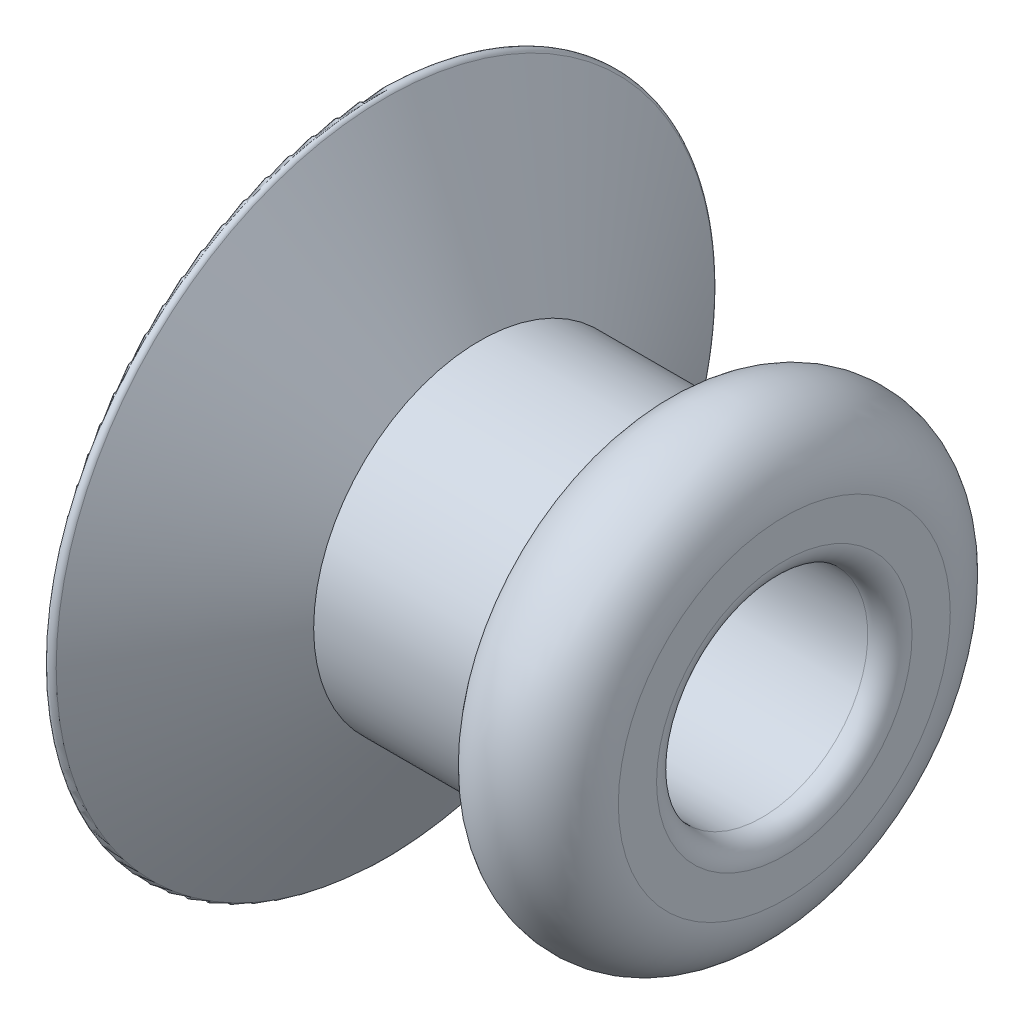
ISO-10303-21;
HEADER;
FILE_DESCRIPTION(('STEP AP214'),'2;1');
FILE_NAME('part.step','',(''),(''),'','','');
FILE_SCHEMA(('AUTOMOTIVE_DESIGN { 1 0 10303 214 1 1 1 1 }'));
ENDSEC;
DATA;
#1=APPLICATION_CONTEXT('core data for automotive mechanical design processes');
#2=APPLICATION_PROTOCOL_DEFINITION('international standard','automotive_design',2000,#1);
#3=PRODUCT_CONTEXT('',#1,'mechanical');
#4=PRODUCT('Part','Part','',(#3));
#5=PRODUCT_RELATED_PRODUCT_CATEGORY('part','',(#4));
#6=PRODUCT_DEFINITION_FORMATION('','',#4);
#7=PRODUCT_DEFINITION_CONTEXT('part definition',#1,'design');
#8=PRODUCT_DEFINITION('design','',#6,#7);
#9=PRODUCT_DEFINITION_SHAPE('','',#8);
#10=(LENGTH_UNIT() NAMED_UNIT(*) SI_UNIT(.MILLI.,.METRE.));
#11=(NAMED_UNIT(*) PLANE_ANGLE_UNIT() SI_UNIT($,.RADIAN.));
#12=(NAMED_UNIT(*) SI_UNIT($,.STERADIAN.) SOLID_ANGLE_UNIT());
#13=UNCERTAINTY_MEASURE_WITH_UNIT(LENGTH_MEASURE(1.E-05),#10,'distance_accuracy_value','');
#14=(GEOMETRIC_REPRESENTATION_CONTEXT(3) GLOBAL_UNCERTAINTY_ASSIGNED_CONTEXT((#13)) GLOBAL_UNIT_ASSIGNED_CONTEXT((#10,
#11,#12)) REPRESENTATION_CONTEXT('',''));
#15=CARTESIAN_POINT('',(0.,0.,0.));
#16=DIRECTION('',(0.,0.,1.));
#17=DIRECTION('',(1.,0.,0.));
#18=AXIS2_PLACEMENT_3D('',#15,#16,#17);
#19=CARTESIAN_POINT('',(0.05,0.,0.));
#20=DIRECTION('',(-1.,0.,0.));
#21=DIRECTION('',(0.,0.,1.));
#22=AXIS2_PLACEMENT_3D('',#19,#20,#21);
#23=TOROIDAL_SURFACE('',#22,2.95,0.0499999999999998);
#24=CARTESIAN_POINT('',(0.0933012701892218,0.,0.));
#25=DIRECTION('',(-1.,0.,0.));
#26=DIRECTION('',(0.,0.,1.));
#27=AXIS2_PLACEMENT_3D('',#24,#25,#26);
#28=CIRCLE('',#27,2.975);
#29=CARTESIAN_POINT('',(0.0933012701892218,0.,2.975));
#30=VERTEX_POINT('',#29);
#31=EDGE_CURVE('E10',#30,#30,#28,.T.);
#32=ORIENTED_EDGE('',*,*,#31,.T.);
#33=EDGE_LOOP('',(#32));
#34=FACE_BOUND('',#33,.T.);
#35=CARTESIAN_POINT('',(0.,0.,0.));
#36=DIRECTION('',(-1.,0.,0.));
#37=DIRECTION('',(0.,0.,1.));
#38=AXIS2_PLACEMENT_3D('',#35,#36,#37);
#39=CIRCLE('',#38,2.95);
#40=CARTESIAN_POINT('',(0.,0.,2.95));
#41=VERTEX_POINT('',#40);
#42=EDGE_CURVE('E72',#41,#41,#39,.T.);
#43=ORIENTED_EDGE('',*,*,#42,.F.);
#44=EDGE_LOOP('',(#43));
#45=FACE_BOUND('',#44,.T.);
#46=ADVANCED_FACE('F38',(#34,#45),#23,.T.);
#47=CARTESIAN_POINT('',(0.0933012701892218,0.,0.));
#48=DIRECTION('',(-1.,0.,0.));
#49=DIRECTION('',(0.,0.,1.));
#50=AXIS2_PLACEMENT_3D('',#47,#48,#49);
#51=CONICAL_SURFACE('',#50,2.975,1.0471975511966);
#52=CARTESIAN_POINT('',(0.944892917243914,0.,0.));
#53=DIRECTION('',(-1.,0.,0.));
#54=DIRECTION('',(0.,0.,1.));
#55=AXIS2_PLACEMENT_3D('',#52,#53,#54);
#56=CIRCLE('',#55,1.5);
#57=CARTESIAN_POINT('',(0.944892917243914,0.,1.5));
#58=VERTEX_POINT('',#57);
#59=EDGE_CURVE('E44',#58,#58,#56,.T.);
#60=ORIENTED_EDGE('',*,*,#59,.T.);
#61=EDGE_LOOP('',(#60));
#62=FACE_BOUND('',#61,.T.);
#63=ORIENTED_EDGE('',*,*,#31,.F.);
#64=EDGE_LOOP('',(#63));
#65=FACE_BOUND('',#64,.T.);
#66=ADVANCED_FACE('F80',(#62,#65),#51,.T.);
#67=CARTESIAN_POINT('',(0.,0.,0.));
#68=DIRECTION('',(-1.,0.,0.));
#69=DIRECTION('',(0.,0.,1.));
#70=AXIS2_PLACEMENT_3D('',#67,#68,#69);
#71=CYLINDRICAL_SURFACE('',#70,1.5);
#72=CARTESIAN_POINT('',(2.5,0.,0.));
#73=DIRECTION('',(-1.,0.,0.));
#74=DIRECTION('',(0.,0.,1.));
#75=AXIS2_PLACEMENT_3D('',#72,#73,#74);
#76=CIRCLE('',#75,1.5);
#77=CARTESIAN_POINT('',(2.5,0.,1.5));
#78=VERTEX_POINT('',#77);
#79=EDGE_CURVE('E49',#78,#78,#76,.T.);
#80=ORIENTED_EDGE('',*,*,#79,.T.);
#81=EDGE_LOOP('',(#80));
#82=FACE_BOUND('',#81,.T.);
#83=ORIENTED_EDGE('',*,*,#59,.F.);
#84=EDGE_LOOP('',(#83));
#85=FACE_BOUND('',#84,.T.);
#86=ADVANCED_FACE('F84',(#82,#85),#71,.T.);
#87=CARTESIAN_POINT('',(3.09903810567666,0.,0.));
#88=DIRECTION('',(-1.,0.,0.));
#89=DIRECTION('',(0.,0.,1.));
#90=AXIS2_PLACEMENT_3D('',#87,#88,#89);
#91=TOROIDAL_SURFACE('',#90,1.5,0.599038105676656);
#92=CARTESIAN_POINT('',(3.69807621135331,0.,0.));
#93=DIRECTION('',(-1.,0.,0.));
#94=DIRECTION('',(0.,0.,1.));
#95=AXIS2_PLACEMENT_3D('',#92,#93,#94);
#96=CIRCLE('',#95,1.5);
#97=CARTESIAN_POINT('',(3.69807621135331,0.,1.5));
#98=VERTEX_POINT('',#97);
#99=EDGE_CURVE('E55',#98,#98,#96,.T.);
#100=ORIENTED_EDGE('',*,*,#99,.T.);
#101=EDGE_LOOP('',(#100));
#102=FACE_BOUND('',#101,.T.);
#103=ORIENTED_EDGE('',*,*,#79,.F.);
#104=EDGE_LOOP('',(#103));
#105=FACE_BOUND('',#104,.T.);
#106=ADVANCED_FACE('F88',(#102,#105),#91,.T.);
#107=CARTESIAN_POINT('',(3.69807621135331,-1.15446581987386,0.));
#108=DIRECTION('',(1.,0.,0.));
#109=DIRECTION('',(0.,0.,-1.));
#110=AXIS2_PLACEMENT_3D('',#107,#108,#109);
#111=PLANE('',#110);
#112=CARTESIAN_POINT('',(3.69807621135331,0.,0.));
#113=DIRECTION('',(-1.,0.,0.));
#114=DIRECTION('',(0.,0.,1.));
#115=AXIS2_PLACEMENT_3D('',#112,#113,#114);
#116=CIRCLE('',#115,1.15446581987386);
#117=CARTESIAN_POINT('',(3.69807621135331,0.,1.15446581987386));
#118=VERTEX_POINT('',#117);
#119=EDGE_CURVE('E60',#118,#118,#116,.T.);
#120=ORIENTED_EDGE('',*,*,#119,.T.);
#121=EDGE_LOOP('',(#120));
#122=FACE_BOUND('',#121,.T.);
#123=ORIENTED_EDGE('',*,*,#99,.F.);
#124=EDGE_LOOP('',(#123));
#125=FACE_BOUND('',#124,.T.);
#126=ADVANCED_FACE('F95',(#122,#125),#111,.T.);
#127=CARTESIAN_POINT('',(3.49807621135331,0.,0.));
#128=DIRECTION('',(-1.,0.,0.));
#129=DIRECTION('',(0.,0.,1.));
#130=AXIS2_PLACEMENT_3D('',#127,#128,#129);
#131=TOROIDAL_SURFACE('',#130,1.15446581987386,0.2);
#132=CARTESIAN_POINT('',(3.49807621135331,0.,0.));
#133=DIRECTION('',(-1.,0.,0.));
#134=DIRECTION('',(0.,0.,1.));
#135=AXIS2_PLACEMENT_3D('',#132,#133,#134);
#136=CIRCLE('',#135,0.95446581987386);
#137=CARTESIAN_POINT('',(3.49807621135331,0.,0.95446581987386));
#138=VERTEX_POINT('',#137);
#139=EDGE_CURVE('E63',#138,#138,#136,.T.);
#140=ORIENTED_EDGE('',*,*,#139,.T.);
#141=EDGE_LOOP('',(#140));
#142=FACE_BOUND('',#141,.T.);
#143=ORIENTED_EDGE('',*,*,#119,.F.);
#144=EDGE_LOOP('',(#143));
#145=FACE_BOUND('',#144,.T.);
#146=ADVANCED_FACE('F99',(#142,#145),#131,.T.);
#147=CARTESIAN_POINT('',(0.,0.,0.));
#148=DIRECTION('',(-1.,0.,0.));
#149=DIRECTION('',(0.,0.,1.));
#150=AXIS2_PLACEMENT_3D('',#147,#148,#149);
#151=CYLINDRICAL_SURFACE('',#150,0.954465819873862);
#152=CARTESIAN_POINT('',(0.2,0.,0.));
#153=DIRECTION('',(-1.,0.,0.));
#154=DIRECTION('',(0.,0.,1.));
#155=AXIS2_PLACEMENT_3D('',#152,#153,#154);
#156=CIRCLE('',#155,0.954465819873863);
#157=CARTESIAN_POINT('',(0.2,0.,0.954465819873863));
#158=VERTEX_POINT('',#157);
#159=EDGE_CURVE('E66',#158,#158,#156,.T.);
#160=ORIENTED_EDGE('',*,*,#159,.T.);
#161=EDGE_LOOP('',(#160));
#162=FACE_BOUND('',#161,.T.);
#163=ORIENTED_EDGE('',*,*,#139,.F.);
#164=EDGE_LOOP('',(#163));
#165=FACE_BOUND('',#164,.T.);
#166=ADVANCED_FACE('F103',(#162,#165),#151,.F.);
#167=CARTESIAN_POINT('',(0.2,0.,0.));
#168=DIRECTION('',(-1.,0.,0.));
#169=DIRECTION('',(0.,0.,1.));
#170=AXIS2_PLACEMENT_3D('',#167,#168,#169);
#171=TOROIDAL_SURFACE('',#170,1.15446581987386,0.2);
#172=CARTESIAN_POINT('',(0.,0.,0.));
#173=DIRECTION('',(-1.,0.,0.));
#174=DIRECTION('',(0.,0.,1.));
#175=AXIS2_PLACEMENT_3D('',#172,#173,#174);
#176=CIRCLE('',#175,1.15446581987386);
#177=CARTESIAN_POINT('',(0.,0.,1.15446581987386));
#178=VERTEX_POINT('',#177);
#179=EDGE_CURVE('E69',#178,#178,#176,.T.);
#180=ORIENTED_EDGE('',*,*,#179,.T.);
#181=EDGE_LOOP('',(#180));
#182=FACE_BOUND('',#181,.T.);
#183=ORIENTED_EDGE('',*,*,#159,.F.);
#184=EDGE_LOOP('',(#183));
#185=FACE_BOUND('',#184,.T.);
#186=ADVANCED_FACE('F107',(#182,#185),#171,.T.);
#187=CARTESIAN_POINT('',(0.,-1.15446581987386,0.));
#188=DIRECTION('',(-1.,0.,0.));
#189=DIRECTION('',(0.,0.,1.));
#190=AXIS2_PLACEMENT_3D('',#187,#188,#189);
#191=PLANE('',#190);
#192=ORIENTED_EDGE('',*,*,#42,.T.);
#193=EDGE_LOOP('',(#192));
#194=FACE_BOUND('',#193,.T.);
#195=ORIENTED_EDGE('',*,*,#179,.F.);
#196=EDGE_LOOP('',(#195));
#197=FACE_BOUND('',#196,.T.);
#198=ADVANCED_FACE('F76',(#194,#197),#191,.T.);
#199=CLOSED_SHELL('',(#46,#66,#86,#106,#126,#146,#166,#186,#198));
#200=MANIFOLD_SOLID_BREP('B2',#199);
#201=ADVANCED_BREP_SHAPE_REPRESENTATION('',(#18,#200),#14);
#202=SHAPE_DEFINITION_REPRESENTATION(#9,#201);
ENDSEC;
END-ISO-10303-21;
